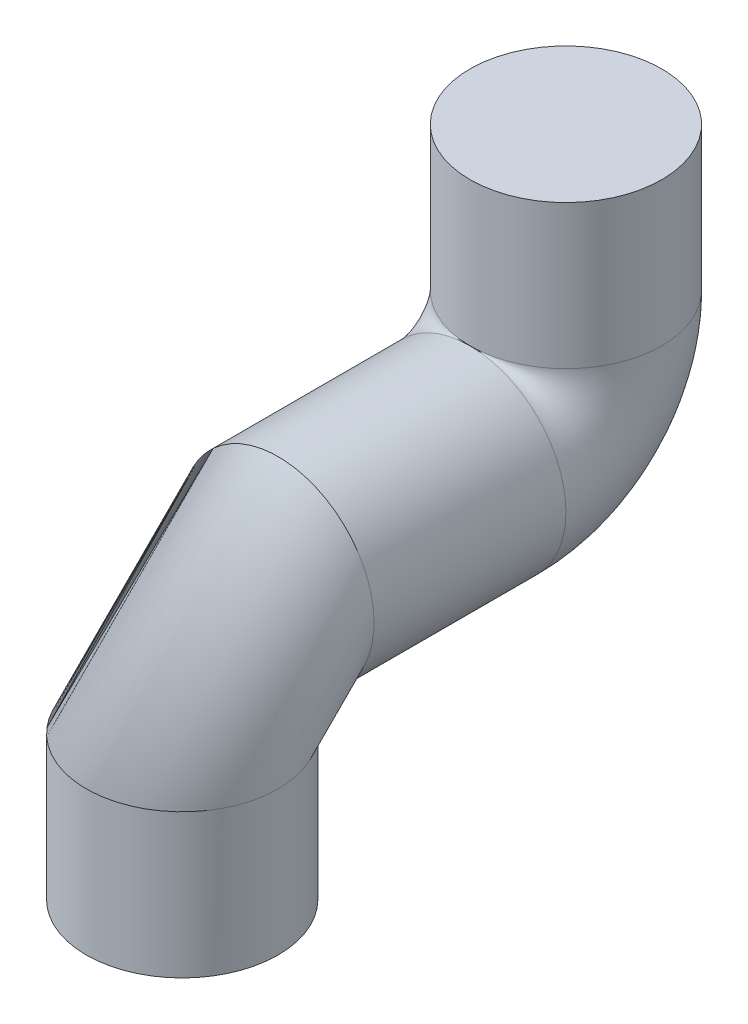
ISO-10303-21;
HEADER;
FILE_DESCRIPTION(('STEP AP214'),'2;1');
FILE_NAME('part.step','',(''),(''),'','','');
FILE_SCHEMA(('AUTOMOTIVE_DESIGN { 1 0 10303 214 1 1 1 1 }'));
ENDSEC;
DATA;
#1=APPLICATION_CONTEXT('core data for automotive mechanical design processes');
#2=APPLICATION_PROTOCOL_DEFINITION('international standard','automotive_design',2000,#1);
#3=PRODUCT_CONTEXT('',#1,'mechanical');
#4=PRODUCT('Part','Part','',(#3));
#5=PRODUCT_RELATED_PRODUCT_CATEGORY('part','',(#4));
#6=PRODUCT_DEFINITION_FORMATION('','',#4);
#7=PRODUCT_DEFINITION_CONTEXT('part definition',#1,'design');
#8=PRODUCT_DEFINITION('design','',#6,#7);
#9=PRODUCT_DEFINITION_SHAPE('','',#8);
#10=(LENGTH_UNIT() NAMED_UNIT(*) SI_UNIT(.MILLI.,.METRE.));
#11=(NAMED_UNIT(*) PLANE_ANGLE_UNIT() SI_UNIT($,.RADIAN.));
#12=(NAMED_UNIT(*) SI_UNIT($,.STERADIAN.) SOLID_ANGLE_UNIT());
#13=UNCERTAINTY_MEASURE_WITH_UNIT(LENGTH_MEASURE(1.E-05),#10,'distance_accuracy_value','');
#14=(GEOMETRIC_REPRESENTATION_CONTEXT(3) GLOBAL_UNCERTAINTY_ASSIGNED_CONTEXT((#13)) GLOBAL_UNIT_ASSIGNED_CONTEXT((#10,
#11,#12)) REPRESENTATION_CONTEXT('',''));
#15=CARTESIAN_POINT('',(0.,0.,0.));
#16=DIRECTION('',(0.,0.,1.));
#17=DIRECTION('',(1.,0.,0.));
#18=AXIS2_PLACEMENT_3D('',#15,#16,#17);
#19=CARTESIAN_POINT('',(0.,75.,-60.));
#20=DIRECTION('',(0.,1.,0.));
#21=DIRECTION('',(0.,0.,1.));
#22=AXIS2_PLACEMENT_3D('',#19,#20,#21);
#23=PLANE('',#22);
#24=CARTESIAN_POINT('',(0.,75.,-60.));
#25=DIRECTION('',(0.,1.,0.));
#26=DIRECTION('',(0.,0.,1.));
#27=AXIS2_PLACEMENT_3D('',#24,#25,#26);
#28=CIRCLE('',#27,30.);
#29=CARTESIAN_POINT('',(0.,75.,-30.));
#30=VERTEX_POINT('',#29);
#31=EDGE_CURVE('E75',#30,#30,#28,.T.);
#32=ORIENTED_EDGE('',*,*,#31,.T.);
#33=EDGE_LOOP('',(#32));
#34=FACE_BOUND('',#33,.T.);
#35=ADVANCED_FACE('F43',(#34),#23,.T.);
#36=CARTESIAN_POINT('',(0.,-74.9999999999999,60.));
#37=DIRECTION('',(0.,1.,0.));
#38=DIRECTION('',(0.,0.,1.));
#39=AXIS2_PLACEMENT_3D('',#36,#37,#38);
#40=PLANE('',#39);
#41=CARTESIAN_POINT('',(0.,-74.9999999999999,60.));
#42=DIRECTION('',(0.,-1.,0.));
#43=DIRECTION('',(0.,0.,-1.));
#44=AXIS2_PLACEMENT_3D('',#41,#42,#43);
#45=CIRCLE('',#44,20.);
#46=CARTESIAN_POINT('',(0.,-74.9999999999999,40.));
#47=VERTEX_POINT('',#46);
#48=EDGE_CURVE('E80',#47,#47,#45,.T.);
#49=ORIENTED_EDGE('',*,*,#48,.F.);
#50=EDGE_LOOP('',(#49));
#51=FACE_BOUND('',#50,.T.);
#52=CARTESIAN_POINT('',(0.,-74.9999999999999,60.));
#53=DIRECTION('',(0.,1.,0.));
#54=DIRECTION('',(0.,0.,1.));
#55=AXIS2_PLACEMENT_3D('',#52,#53,#54);
#56=CIRCLE('',#55,30.);
#57=CARTESIAN_POINT('',(0.,-74.9999999999999,90.));
#58=VERTEX_POINT('',#57);
#59=EDGE_CURVE('E11',#58,#58,#56,.T.);
#60=ORIENTED_EDGE('',*,*,#59,.F.);
#61=EDGE_LOOP('',(#60));
#62=FACE_BOUND('',#61,.T.);
#63=ADVANCED_FACE('F97',(#51,#62),#40,.F.);
#64=CARTESIAN_POINT('',(0.,75.,-60.));
#65=DIRECTION('',(0.,-1.,0.));
#66=DIRECTION('',(0.,0.,-1.));
#67=AXIS2_PLACEMENT_3D('',#64,#65,#66);
#68=CYLINDRICAL_SURFACE('',#67,30.);
#69=CARTESIAN_POINT('',(0.,30.,-60.));
#70=DIRECTION('',(0.,1.,0.));
#71=DIRECTION('',(0.,0.,1.));
#72=AXIS2_PLACEMENT_3D('',#69,#70,#71);
#73=CIRCLE('',#72,30.);
#74=CARTESIAN_POINT('',(0.,30.,-30.));
#75=VERTEX_POINT('',#74);
#76=EDGE_CURVE('E57',#75,#75,#73,.T.);
#77=ORIENTED_EDGE('',*,*,#76,.T.);
#78=EDGE_LOOP('',(#77));
#79=FACE_BOUND('',#78,.T.);
#80=ORIENTED_EDGE('',*,*,#31,.F.);
#81=EDGE_LOOP('',(#80));
#82=FACE_BOUND('',#81,.T.);
#83=ADVANCED_FACE('F100',(#79,#82),#68,.T.);
#84=CARTESIAN_POINT('',(0.,30.,0.));
#85=DIRECTION('',(0.,-1.,0.));
#86=DIRECTION('',(0.,0.,1.));
#87=AXIS2_PLACEMENT_3D('',#84,#85,#86);
#88=CIRCLE('',#87,30.);
#89=TRIMMED_CURVE('',#88,(PARAMETER_VALUE(-3.14159263251637)),
(PARAMETER_VALUE(3.14159263251637)),.T.,.PARAMETER.);
#90=CARTESIAN_POINT('',(0.,30.,-30.));
#91=DIRECTION('',(-1.,0.,0.));
#92=AXIS1_PLACEMENT('',#90,#91);
#93=SURFACE_OF_REVOLUTION('',#89,#92);
#94=CARTESIAN_POINT('',(0.,0.,-30.));
#95=DIRECTION('',(0.,0.,-1.));
#96=DIRECTION('',(0.,1.,0.));
#97=AXIS2_PLACEMENT_3D('',#94,#95,#96);
#98=CIRCLE('',#97,30.);
#99=EDGE_CURVE('E67',#75,#75,#98,.T.);
#100=ORIENTED_EDGE('',*,*,#99,.T.);
#101=ORIENTED_EDGE('',*,*,#76,.F.);
#102=EDGE_LOOP('',(#100,#101));
#103=FACE_BOUND('',#102,.T.);
#104=ADVANCED_FACE('F114',(#103),#93,.T.);
#105=CARTESIAN_POINT('',(0.,0.,-30.));
#106=DIRECTION('',(0.,0.,1.));
#107=DIRECTION('',(0.,-1.,0.));
#108=AXIS2_PLACEMENT_3D('',#105,#106,#107);
#109=CYLINDRICAL_SURFACE('',#108,30.);
#110=CARTESIAN_POINT('',(0.,0.,30.));
#111=DIRECTION('',(0.,0.,-1.));
#112=DIRECTION('',(0.,1.,0.));
#113=AXIS2_PLACEMENT_3D('',#110,#111,#112);
#114=CIRCLE('',#113,30.);
#115=CARTESIAN_POINT('',(0.,-30.,30.));
#116=VERTEX_POINT('',#115);
#117=EDGE_CURVE('E62',#116,#116,#114,.T.);
#118=ORIENTED_EDGE('',*,*,#117,.T.);
#119=EDGE_LOOP('',(#118));
#120=FACE_BOUND('',#119,.T.);
#121=ORIENTED_EDGE('',*,*,#99,.F.);
#122=EDGE_LOOP('',(#121));
#123=FACE_BOUND('',#122,.T.);
#124=ADVANCED_FACE('F109',(#120,#123),#109,.T.);
#125=CARTESIAN_POINT('',(0.,-30.,30.));
#126=DIRECTION('',(1.,0.,0.));
#127=DIRECTION('',(0.,0.,-1.));
#128=AXIS2_PLACEMENT_3D('',#125,#126,#127);
#129=TOROIDAL_SURFACE('',#128,30.,30.);
#130=CARTESIAN_POINT('',(0.,-30.,60.));
#131=DIRECTION('',(0.,1.,0.));
#132=DIRECTION('',(0.,0.,1.));
#133=AXIS2_PLACEMENT_3D('',#130,#131,#132);
#134=CIRCLE('',#133,30.);
#135=EDGE_CURVE('E51',#116,#116,#134,.T.);
#136=ORIENTED_EDGE('',*,*,#135,.T.);
#137=ORIENTED_EDGE('',*,*,#117,.F.);
#138=EDGE_LOOP('',(#136,#137));
#139=FACE_BOUND('',#138,.T.);
#140=ADVANCED_FACE('F63',(#139),#129,.T.);
#141=CARTESIAN_POINT('',(0.,-30.,60.));
#142=DIRECTION('',(0.,-1.,0.));
#143=DIRECTION('',(0.,0.,-1.));
#144=AXIS2_PLACEMENT_3D('',#141,#142,#143);
#145=CYLINDRICAL_SURFACE('',#144,30.);
#146=ORIENTED_EDGE('',*,*,#59,.T.);
#147=EDGE_LOOP('',(#146));
#148=FACE_BOUND('',#147,.T.);
#149=ORIENTED_EDGE('',*,*,#135,.F.);
#150=EDGE_LOOP('',(#149));
#151=FACE_BOUND('',#150,.T.);
#152=ADVANCED_FACE('F93',(#148,#151),#145,.T.);
#153=CARTESIAN_POINT('',(0.,-64.9999999999999,60.));
#154=DIRECTION('',(0.,-1.,0.));
#155=DIRECTION('',(0.,0.,-1.));
#156=AXIS2_PLACEMENT_3D('',#153,#154,#155);
#157=CYLINDRICAL_SURFACE('',#156,20.);
#158=CARTESIAN_POINT('',(0.,-64.9999999999999,60.));
#159=DIRECTION('',(0.,-1.,0.));
#160=DIRECTION('',(0.,0.,-1.));
#161=AXIS2_PLACEMENT_3D('',#158,#159,#160);
#162=CIRCLE('',#161,20.);
#163=CARTESIAN_POINT('',(0.,-64.9999999999999,40.));
#164=VERTEX_POINT('',#163);
#165=EDGE_CURVE('E79',#164,#164,#162,.T.);
#166=ORIENTED_EDGE('',*,*,#165,.F.);
#167=EDGE_LOOP('',(#166));
#168=FACE_BOUND('',#167,.T.);
#169=ORIENTED_EDGE('',*,*,#48,.T.);
#170=EDGE_LOOP('',(#169));
#171=FACE_BOUND('',#170,.T.);
#172=ADVANCED_FACE('F90',(#168,#171),#157,.F.);
#173=CARTESIAN_POINT('',(0.,-64.9999999999999,60.));
#174=DIRECTION('',(0.,-1.,0.));
#175=DIRECTION('',(0.,0.,-1.));
#176=AXIS2_PLACEMENT_3D('',#173,#174,#175);
#177=PLANE('',#176);
#178=ORIENTED_EDGE('',*,*,#165,.T.);
#179=EDGE_LOOP('',(#178));
#180=FACE_BOUND('',#179,.T.);
#181=ADVANCED_FACE('F88',(#180),#177,.T.);
#182=CLOSED_SHELL('',(#35,#63,#83,#104,#124,#140,#152,#172,#181));
#183=MANIFOLD_SOLID_BREP('B2',#182);
#184=ADVANCED_BREP_SHAPE_REPRESENTATION('',(#18,#183),#14);
#185=SHAPE_DEFINITION_REPRESENTATION(#9,#184);
ENDSEC;
END-ISO-10303-21;
